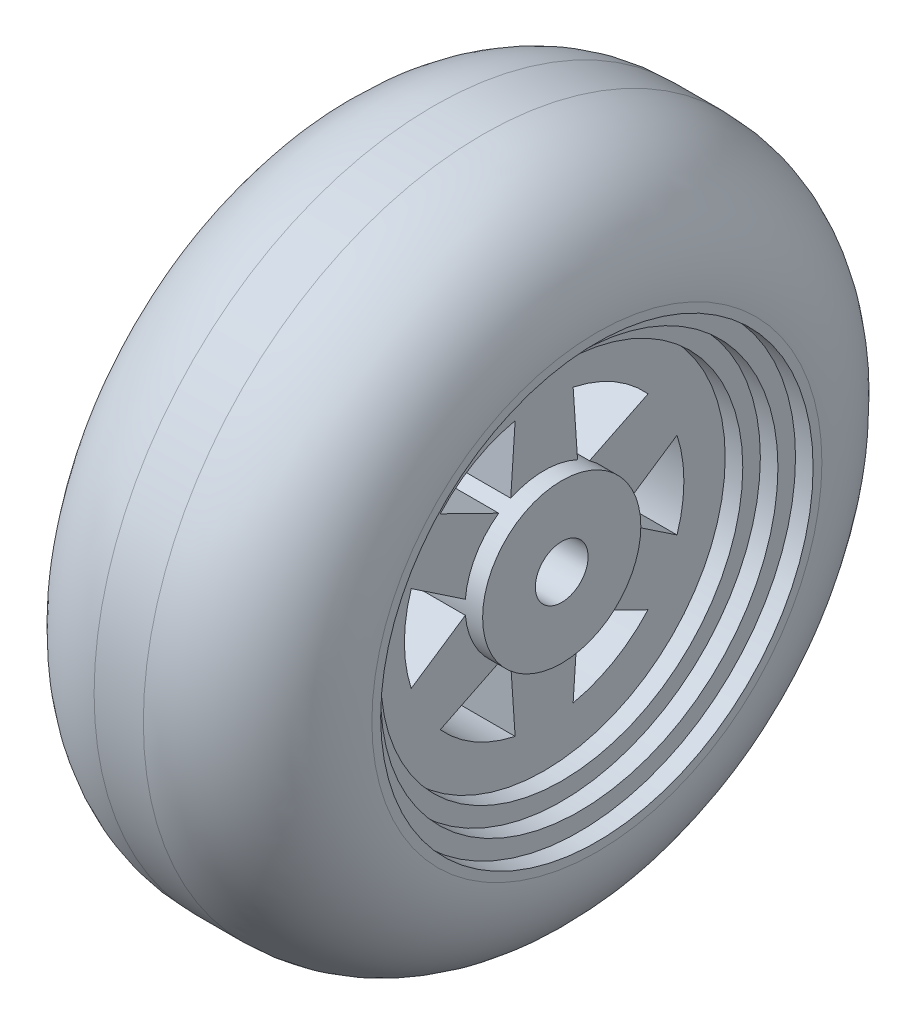
ISO-10303-21;
HEADER;
FILE_DESCRIPTION(('STEP AP214'),'2;1');
FILE_NAME('part.step','',(''),(''),'','','');
FILE_SCHEMA(('AUTOMOTIVE_DESIGN { 1 0 10303 214 1 1 1 1 }'));
ENDSEC;
DATA;
#1=APPLICATION_CONTEXT('core data for automotive mechanical design processes');
#2=APPLICATION_PROTOCOL_DEFINITION('international standard','automotive_design',2000,#1);
#3=PRODUCT_CONTEXT('',#1,'mechanical');
#4=PRODUCT('Part','Part','',(#3));
#5=PRODUCT_RELATED_PRODUCT_CATEGORY('part','',(#4));
#6=PRODUCT_DEFINITION_FORMATION('','',#4);
#7=PRODUCT_DEFINITION_CONTEXT('part definition',#1,'design');
#8=PRODUCT_DEFINITION('design','',#6,#7);
#9=PRODUCT_DEFINITION_SHAPE('','',#8);
#10=(LENGTH_UNIT() NAMED_UNIT(*) SI_UNIT(.MILLI.,.METRE.));
#11=(NAMED_UNIT(*) PLANE_ANGLE_UNIT() SI_UNIT($,.RADIAN.));
#12=(NAMED_UNIT(*) SI_UNIT($,.STERADIAN.) SOLID_ANGLE_UNIT());
#13=UNCERTAINTY_MEASURE_WITH_UNIT(LENGTH_MEASURE(1.E-05),#10,'distance_accuracy_value','');
#14=(GEOMETRIC_REPRESENTATION_CONTEXT(3) GLOBAL_UNCERTAINTY_ASSIGNED_CONTEXT((#13)) GLOBAL_UNIT_ASSIGNED_CONTEXT((#10,
#11,#12)) REPRESENTATION_CONTEXT('',''));
#15=CARTESIAN_POINT('',(0.,0.,0.));
#16=DIRECTION('',(0.,0.,1.));
#17=DIRECTION('',(1.,0.,0.));
#18=AXIS2_PLACEMENT_3D('',#15,#16,#17);
#19=CARTESIAN_POINT('',(12.8,0.,0.));
#20=DIRECTION('',(1.,0.,0.));
#21=DIRECTION('',(0.,0.,-1.));
#22=AXIS2_PLACEMENT_3D('',#19,#20,#21);
#23=PLANE('',#22);
#24=CARTESIAN_POINT('',(12.8,0.,0.));
#25=DIRECTION('',(1.,0.,0.));
#26=DIRECTION('',(0.,0.,-1.));
#27=AXIS2_PLACEMENT_3D('',#24,#25,#26);
#28=CIRCLE('',#27,10.3);
#29=CARTESIAN_POINT('',(12.8,0.,-10.3));
#30=VERTEX_POINT('',#29);
#31=EDGE_CURVE('E386',#30,#30,#28,.T.);
#32=ORIENTED_EDGE('',*,*,#31,.T.);
#33=EDGE_LOOP('',(#32));
#34=FACE_BOUND('',#33,.T.);
#35=DIRECTION('',(0.,-0.557279805700208,-0.830324766677918));
#36=VECTOR('',#35,1.);
#37=CARTESIAN_POINT('',(12.8,-0.394159538246702,-4.48270434653114));
#38=LINE('',#37,#36);
#39=CARTESIAN_POINT('',(12.8,-0.394159538246702,-4.48270434653114));
#40=VERTEX_POINT('',#39);
#41=CARTESIAN_POINT('',(12.8,-2.45950250280043,-7.55998329619309));
#42=VERTEX_POINT('',#41);
#43=EDGE_CURVE('E410',#40,#42,#38,.T.);
#44=ORIENTED_EDGE('',*,*,#43,.F.);
#45=CARTESIAN_POINT('',(12.8,0.,0.));
#46=DIRECTION('',(1.,0.,0.));
#47=DIRECTION('',(0.,0.,-1.));
#48=AXIS2_PLACEMENT_3D('',#45,#46,#47);
#49=CIRCLE('',#48,4.5);
#50=CARTESIAN_POINT('',(12.8,-3.68505607262756,-2.58270434653112));
#51=VERTEX_POINT('',#50);
#52=EDGE_CURVE('E269',#40,#51,#49,.F.);
#53=ORIENTED_EDGE('',*,*,#52,.T.);
#54=DIRECTION('',(0.,0.440442438484368,0.897780852091391));
#55=VECTOR('',#54,1.);
#56=CARTESIAN_POINT('',(12.8,-3.68505607262756,-2.58270434653112));
#57=LINE('',#56,#55);
#58=CARTESIAN_POINT('',(12.8,-5.31738633528907,-5.90998329619307));
#59=VERTEX_POINT('',#58);
#60=EDGE_CURVE('E404',#59,#51,#57,.T.);
#61=ORIENTED_EDGE('',*,*,#60,.F.);
#62=CARTESIAN_POINT('',(12.8,0.,0.));
#63=DIRECTION('',(1.,0.,0.));
#64=DIRECTION('',(0.,0.,-1.));
#65=AXIS2_PLACEMENT_3D('',#62,#63,#64);
#66=CIRCLE('',#65,7.95);
#67=CARTESIAN_POINT('',(12.8,-7.77688883808944,-1.64999999999994));
#68=VERTEX_POINT('',#67);
#69=EDGE_CURVE('E351',#68,#59,#66,.T.);
#70=ORIENTED_EDGE('',*,*,#69,.F.);
#71=DIRECTION('',(0.,-0.997722244184567,0.0674560854134801));
#72=VECTOR('',#71,1.);
#73=CARTESIAN_POINT('',(12.8,-4.07921561087424,-1.89999999999997));
#74=LINE('',#73,#72);
#75=CARTESIAN_POINT('',(12.8,-4.07921561087424,-1.89999999999997));
#76=VERTEX_POINT('',#75);
#77=EDGE_CURVE('E215',#76,#68,#74,.T.);
#78=ORIENTED_EDGE('',*,*,#77,.F.);
#79=CARTESIAN_POINT('',(12.8,-4.07921561087421,1.90000000000003));
#80=VERTEX_POINT('',#79);
#81=EDGE_CURVE('E272',#76,#80,#49,.F.);
#82=ORIENTED_EDGE('',*,*,#81,.T.);
#83=DIRECTION('',(0.,0.997722244184568,0.0674560854134662));
#84=VECTOR('',#83,1.);
#85=CARTESIAN_POINT('',(12.8,-4.07921561087421,1.90000000000003));
#86=LINE('',#85,#84);
#87=CARTESIAN_POINT('',(12.8,-7.77688883808942,1.65000000000005));
#88=VERTEX_POINT('',#87);
#89=EDGE_CURVE('E395',#88,#80,#86,.T.);
#90=ORIENTED_EDGE('',*,*,#89,.F.);
#91=CARTESIAN_POINT('',(12.8,0.,0.));
#92=DIRECTION('',(1.,0.,0.));
#93=DIRECTION('',(0.,0.,-1.));
#94=AXIS2_PLACEMENT_3D('',#91,#92,#93);
#95=CIRCLE('',#94,7.95);
#96=CARTESIAN_POINT('',(12.8,-5.31738633528898,5.90998329619314));
#97=VERTEX_POINT('',#96);
#98=EDGE_CURVE('E398',#97,#88,#95,.T.);
#99=ORIENTED_EDGE('',*,*,#98,.F.);
#100=DIRECTION('',(0.,-0.440442438484355,0.897780852091397));
#101=VECTOR('',#100,1.);
#102=CARTESIAN_POINT('',(12.8,-3.68505607262752,2.58270434653117));
#103=LINE('',#102,#101);
#104=CARTESIAN_POINT('',(12.8,-3.68505607262752,2.58270434653117));
#105=VERTEX_POINT('',#104);
#106=EDGE_CURVE('E401',#105,#97,#103,.T.);
#107=ORIENTED_EDGE('',*,*,#106,.F.);
#108=CARTESIAN_POINT('',(12.8,-0.394159538246828,4.48270434653113));
#109=VERTEX_POINT('',#108);
#110=EDGE_CURVE('E680',#105,#109,#49,.F.);
#111=ORIENTED_EDGE('',*,*,#110,.T.);
#112=DIRECTION('',(0.,0.557279805700205,-0.83032476667792));
#113=VECTOR('',#112,1.);
#114=CARTESIAN_POINT('',(12.8,-0.394159538246827,4.48270434653112));
#115=LINE('',#114,#113);
#116=CARTESIAN_POINT('',(12.8,-2.45950250280054,7.55998329619308));
#117=VERTEX_POINT('',#116);
#118=EDGE_CURVE('E258',#117,#109,#115,.T.);
#119=ORIENTED_EDGE('',*,*,#118,.F.);
#120=CARTESIAN_POINT('',(12.8,0.,0.));
#121=DIRECTION('',(1.,0.,0.));
#122=DIRECTION('',(0.,0.,-1.));
#123=AXIS2_PLACEMENT_3D('',#120,#121,#122);
#124=CIRCLE('',#123,7.95000000000002);
#125=CARTESIAN_POINT('',(12.8,2.45950250280049,7.55998329619308));
#126=VERTEX_POINT('',#125);
#127=EDGE_CURVE('E389',#126,#117,#124,.T.);
#128=ORIENTED_EDGE('',*,*,#127,.F.);
#129=DIRECTION('',(0.,0.557279805700214,0.830324766677914));
#130=VECTOR('',#129,1.);
#131=CARTESIAN_POINT('',(12.8,0.394159538246733,4.48270434653114));
#132=LINE('',#131,#130);
#133=CARTESIAN_POINT('',(12.8,0.394159538246732,4.48270434653113));
#134=VERTEX_POINT('',#133);
#135=EDGE_CURVE('E392',#134,#126,#132,.T.);
#136=ORIENTED_EDGE('',*,*,#135,.F.);
#137=CARTESIAN_POINT('',(12.8,3.68505607262758,2.5827043465311));
#138=VERTEX_POINT('',#137);
#139=EDGE_CURVE('E682',#134,#138,#49,.F.);
#140=ORIENTED_EDGE('',*,*,#139,.T.);
#141=DIRECTION('',(0.,-0.440442438484374,-0.897780852091388));
#142=VECTOR('',#141,1.);
#143=CARTESIAN_POINT('',(12.8,3.68505607262758,2.5827043465311));
#144=LINE('',#143,#142);
#145=CARTESIAN_POINT('',(12.8,5.31738633528911,5.90998329619303));
#146=VERTEX_POINT('',#145);
#147=EDGE_CURVE('E413',#146,#138,#144,.T.);
#148=ORIENTED_EDGE('',*,*,#147,.F.);
#149=CARTESIAN_POINT('',(12.8,0.,0.));
#150=DIRECTION('',(1.,0.,0.));
#151=DIRECTION('',(0.,0.,-1.));
#152=AXIS2_PLACEMENT_3D('',#149,#150,#151);
#153=CIRCLE('',#152,7.95);
#154=CARTESIAN_POINT('',(12.8,7.77688883808943,1.65));
#155=VERTEX_POINT('',#154);
#156=EDGE_CURVE('E416',#155,#146,#153,.T.);
#157=ORIENTED_EDGE('',*,*,#156,.F.);
#158=DIRECTION('',(0.,0.997722244184568,-0.0674560854134731));
#159=VECTOR('',#158,1.);
#160=CARTESIAN_POINT('',(12.8,4.07921561087423,1.9));
#161=LINE('',#160,#159);
#162=CARTESIAN_POINT('',(12.8,4.07921561087423,1.9));
#163=VERTEX_POINT('',#162);
#164=EDGE_CURVE('E419',#163,#155,#161,.T.);
#165=ORIENTED_EDGE('',*,*,#164,.F.);
#166=CARTESIAN_POINT('',(12.8,4.07921561087423,-1.9));
#167=VERTEX_POINT('',#166);
#168=EDGE_CURVE('E267',#163,#167,#49,.F.);
#169=ORIENTED_EDGE('',*,*,#168,.T.);
#170=DIRECTION('',(0.,-0.997722244184568,-0.0674560854134731));
#171=VECTOR('',#170,1.);
#172=CARTESIAN_POINT('',(12.8,4.07921561087423,-1.9));
#173=LINE('',#172,#171);
#174=CARTESIAN_POINT('',(12.8,7.77688883808943,-1.65));
#175=VERTEX_POINT('',#174);
#176=EDGE_CURVE('E422',#175,#167,#173,.T.);
#177=ORIENTED_EDGE('',*,*,#176,.F.);
#178=CARTESIAN_POINT('',(12.8,0.,0.));
#179=DIRECTION('',(1.,0.,0.));
#180=DIRECTION('',(0.,0.,-1.));
#181=AXIS2_PLACEMENT_3D('',#178,#179,#180);
#182=CIRCLE('',#181,7.95);
#183=CARTESIAN_POINT('',(12.8,5.31738633528903,-5.90998329619311));
#184=VERTEX_POINT('',#183);
#185=EDGE_CURVE('E425',#184,#175,#182,.T.);
#186=ORIENTED_EDGE('',*,*,#185,.F.);
#187=DIRECTION('',(0.,0.440442438484361,-0.897780852091394));
#188=VECTOR('',#187,1.);
#189=CARTESIAN_POINT('',(12.8,3.68505607262754,-2.58270434653115));
#190=LINE('',#189,#188);
#191=CARTESIAN_POINT('',(12.8,3.68505607262754,-2.58270434653115));
#192=VERTEX_POINT('',#191);
#193=EDGE_CURVE('E198',#192,#184,#190,.T.);
#194=ORIENTED_EDGE('',*,*,#193,.F.);
#195=CARTESIAN_POINT('',(12.8,0.,0.));
#196=DIRECTION('',(1.,0.,0.));
#197=DIRECTION('',(0.,0.,-1.));
#198=AXIS2_PLACEMENT_3D('',#195,#196,#197);
#199=CIRCLE('',#198,4.5);
#200=CARTESIAN_POINT('',(12.8,0.39415953824667,-4.48270434653114));
#201=VERTEX_POINT('',#200);
#202=EDGE_CURVE('E192',#201,#192,#199,.T.);
#203=ORIENTED_EDGE('',*,*,#202,.F.);
#204=DIRECTION('',(0.,-0.557279805700203,0.830324766677921));
#205=VECTOR('',#204,1.);
#206=CARTESIAN_POINT('',(12.8,0.39415953824667,-4.48270434653114));
#207=LINE('',#206,#205);
#208=CARTESIAN_POINT('',(12.8,2.45950250280037,-7.5599832961931));
#209=VERTEX_POINT('',#208);
#210=EDGE_CURVE('E195',#209,#201,#207,.T.);
#211=ORIENTED_EDGE('',*,*,#210,.F.);
#212=CARTESIAN_POINT('',(12.8,0.,0.));
#213=DIRECTION('',(1.,0.,0.));
#214=DIRECTION('',(0.,0.,-1.));
#215=AXIS2_PLACEMENT_3D('',#212,#213,#214);
#216=CIRCLE('',#215,7.95);
#217=EDGE_CURVE('E214',#42,#209,#216,.T.);
#218=ORIENTED_EDGE('',*,*,#217,.F.);
#219=EDGE_LOOP('',(#44,#53,#61,#70,#78,#82,#90,#99,#107,#111,#119,#128,#136,#140,#148,#157,#165,
#169,#177,#186,#194,#203,#211,#218));
#220=FACE_BOUND('',#219,.T.);
#221=ADVANCED_FACE('F31',(#34,#220),#23,.T.);
#222=CARTESIAN_POINT('',(1.,0.,0.));
#223=DIRECTION('',(-1.,0.,0.));
#224=DIRECTION('',(0.,0.,1.));
#225=AXIS2_PLACEMENT_3D('',#222,#223,#224);
#226=PLANE('',#225);
#227=CARTESIAN_POINT('',(1.,0.,0.));
#228=DIRECTION('',(-1.,0.,0.));
#229=DIRECTION('',(0.,0.,1.));
#230=AXIS2_PLACEMENT_3D('',#227,#228,#229);
#231=CIRCLE('',#230,12.3);
#232=CARTESIAN_POINT('',(1.,0.,12.3));
#233=VERTEX_POINT('',#232);
#234=EDGE_CURVE('E651',#233,#233,#231,.T.);
#235=ORIENTED_EDGE('',*,*,#234,.T.);
#236=EDGE_LOOP('',(#235));
#237=FACE_BOUND('',#236,.T.);
#238=DIRECTION('',(0.,-0.557279805700205,0.83032476667792));
#239=VECTOR('',#238,1.);
#240=CARTESIAN_POINT('',(1.,-0.394159538246827,4.48270434653112));
#241=LINE('',#240,#239);
#242=CARTESIAN_POINT('',(1.,-0.394159538246828,4.48270434653112));
#243=VERTEX_POINT('',#242);
#244=CARTESIAN_POINT('',(1.,-2.45950250280054,7.55998329619308));
#245=VERTEX_POINT('',#244);
#246=EDGE_CURVE('E261',#243,#245,#241,.T.);
#247=ORIENTED_EDGE('',*,*,#246,.F.);
#248=CARTESIAN_POINT('',(1.,0.,0.));
#249=DIRECTION('',(-1.,0.,0.));
#250=DIRECTION('',(0.,0.,1.));
#251=AXIS2_PLACEMENT_3D('',#248,#249,#250);
#252=CIRCLE('',#251,4.5);
#253=CARTESIAN_POINT('',(1.,-3.68505607262752,2.58270434653117));
#254=VERTEX_POINT('',#253);
#255=EDGE_CURVE('E265',#243,#254,#252,.F.);
#256=ORIENTED_EDGE('',*,*,#255,.T.);
#257=DIRECTION('',(0.,0.440442438484355,-0.897780852091397));
#258=VECTOR('',#257,1.);
#259=CARTESIAN_POINT('',(1.,-3.68505607262752,2.58270434653117));
#260=LINE('',#259,#258);
#261=CARTESIAN_POINT('',(1.,-5.31738633528898,5.90998329619314));
#262=VERTEX_POINT('',#261);
#263=EDGE_CURVE('E360',#262,#254,#260,.T.);
#264=ORIENTED_EDGE('',*,*,#263,.F.);
#265=CARTESIAN_POINT('',(1.,0.,0.));
#266=DIRECTION('',(-1.,0.,0.));
#267=DIRECTION('',(0.,0.,1.));
#268=AXIS2_PLACEMENT_3D('',#265,#266,#267);
#269=CIRCLE('',#268,7.95);
#270=CARTESIAN_POINT('',(1.,-7.77688883808942,1.65000000000005));
#271=VERTEX_POINT('',#270);
#272=EDGE_CURVE('E670',#271,#262,#269,.T.);
#273=ORIENTED_EDGE('',*,*,#272,.F.);
#274=DIRECTION('',(0.,-0.997722244184568,-0.0674560854134662));
#275=VECTOR('',#274,1.);
#276=CARTESIAN_POINT('',(1.,-4.07921561087421,1.90000000000003));
#277=LINE('',#276,#275);
#278=CARTESIAN_POINT('',(1.,-4.07921561087421,1.90000000000003));
#279=VERTEX_POINT('',#278);
#280=EDGE_CURVE('E667',#279,#271,#277,.T.);
#281=ORIENTED_EDGE('',*,*,#280,.F.);
#282=CARTESIAN_POINT('',(1.,-4.07921561087424,-1.89999999999997));
#283=VERTEX_POINT('',#282);
#284=EDGE_CURVE('E268',#279,#283,#252,.F.);
#285=ORIENTED_EDGE('',*,*,#284,.T.);
#286=DIRECTION('',(0.,0.997722244184567,-0.0674560854134801));
#287=VECTOR('',#286,1.);
#288=CARTESIAN_POINT('',(1.,-4.07921561087424,-1.89999999999997));
#289=LINE('',#288,#287);
#290=CARTESIAN_POINT('',(1.,-7.77688883808944,-1.64999999999994));
#291=VERTEX_POINT('',#290);
#292=EDGE_CURVE('E345',#291,#283,#289,.T.);
#293=ORIENTED_EDGE('',*,*,#292,.F.);
#294=CARTESIAN_POINT('',(1.,0.,0.));
#295=DIRECTION('',(-1.,0.,0.));
#296=DIRECTION('',(0.,0.,1.));
#297=AXIS2_PLACEMENT_3D('',#294,#295,#296);
#298=CIRCLE('',#297,7.95);
#299=CARTESIAN_POINT('',(1.,-5.31738633528907,-5.90998329619307));
#300=VERTEX_POINT('',#299);
#301=EDGE_CURVE('E353',#300,#291,#298,.T.);
#302=ORIENTED_EDGE('',*,*,#301,.F.);
#303=DIRECTION('',(0.,-0.440442438484368,-0.897780852091391));
#304=VECTOR('',#303,1.);
#305=CARTESIAN_POINT('',(1.,-3.68505607262756,-2.58270434653112));
#306=LINE('',#305,#304);
#307=CARTESIAN_POINT('',(1.,-3.68505607262756,-2.58270434653112));
#308=VERTEX_POINT('',#307);
#309=EDGE_CURVE('E356',#308,#300,#306,.T.);
#310=ORIENTED_EDGE('',*,*,#309,.F.);
#311=CARTESIAN_POINT('',(1.,-0.394159538246701,-4.48270434653114));
#312=VERTEX_POINT('',#311);
#313=EDGE_CURVE('E687',#308,#312,#252,.F.);
#314=ORIENTED_EDGE('',*,*,#313,.T.);
#315=DIRECTION('',(0.,0.557279805700208,0.830324766677918));
#316=VECTOR('',#315,1.);
#317=CARTESIAN_POINT('',(1.,-0.394159538246702,-4.48270434653114));
#318=LINE('',#317,#316);
#319=CARTESIAN_POINT('',(1.,-2.45950250280043,-7.55998329619309));
#320=VERTEX_POINT('',#319);
#321=EDGE_CURVE('E368',#320,#312,#318,.T.);
#322=ORIENTED_EDGE('',*,*,#321,.F.);
#323=CARTESIAN_POINT('',(1.,0.,0.));
#324=DIRECTION('',(-1.,0.,0.));
#325=DIRECTION('',(0.,0.,1.));
#326=AXIS2_PLACEMENT_3D('',#323,#324,#325);
#327=CIRCLE('',#326,7.95);
#328=CARTESIAN_POINT('',(1.,2.45950250280037,-7.5599832961931));
#329=VERTEX_POINT('',#328);
#330=EDGE_CURVE('E365',#329,#320,#327,.T.);
#331=ORIENTED_EDGE('',*,*,#330,.F.);
#332=DIRECTION('',(0.,0.557279805700203,-0.830324766677921));
#333=VECTOR('',#332,1.);
#334=CARTESIAN_POINT('',(1.,0.39415953824667,-4.48270434653114));
#335=LINE('',#334,#333);
#336=CARTESIAN_POINT('',(1.,0.39415953824667,-4.48270434653114));
#337=VERTEX_POINT('',#336);
#338=EDGE_CURVE('E358',#337,#329,#335,.T.);
#339=ORIENTED_EDGE('',*,*,#338,.F.);
#340=CARTESIAN_POINT('',(1.,3.68505607262754,-2.58270434653115));
#341=VERTEX_POINT('',#340);
#342=EDGE_CURVE('E219',#337,#341,#252,.F.);
#343=ORIENTED_EDGE('',*,*,#342,.T.);
#344=DIRECTION('',(0.,-0.440442438484361,0.897780852091394));
#345=VECTOR('',#344,1.);
#346=CARTESIAN_POINT('',(1.,3.68505607262754,-2.58270434653115));
#347=LINE('',#346,#345);
#348=CARTESIAN_POINT('',(1.,5.31738633528903,-5.90998329619311));
#349=VERTEX_POINT('',#348);
#350=EDGE_CURVE('E380',#349,#341,#347,.T.);
#351=ORIENTED_EDGE('',*,*,#350,.F.);
#352=CARTESIAN_POINT('',(1.,0.,0.));
#353=DIRECTION('',(-1.,0.,0.));
#354=DIRECTION('',(0.,0.,1.));
#355=AXIS2_PLACEMENT_3D('',#352,#353,#354);
#356=CIRCLE('',#355,7.95);
#357=CARTESIAN_POINT('',(1.,7.77688883808943,-1.65));
#358=VERTEX_POINT('',#357);
#359=EDGE_CURVE('E46',#358,#349,#356,.T.);
#360=ORIENTED_EDGE('',*,*,#359,.F.);
#361=DIRECTION('',(0.,0.997722244184568,0.0674560854134731));
#362=VECTOR('',#361,1.);
#363=CARTESIAN_POINT('',(1.,4.07921561087423,-1.9));
#364=LINE('',#363,#362);
#365=CARTESIAN_POINT('',(1.,4.07921561087423,-1.9));
#366=VERTEX_POINT('',#365);
#367=EDGE_CURVE('E377',#366,#358,#364,.T.);
#368=ORIENTED_EDGE('',*,*,#367,.F.);
#369=CARTESIAN_POINT('',(1.,4.07921561087423,1.9));
#370=VERTEX_POINT('',#369);
#371=EDGE_CURVE('E264',#366,#370,#252,.F.);
#372=ORIENTED_EDGE('',*,*,#371,.T.);
#373=DIRECTION('',(0.,-0.997722244184568,0.0674560854134731));
#374=VECTOR('',#373,1.);
#375=CARTESIAN_POINT('',(1.,4.07921561087423,1.9));
#376=LINE('',#375,#374);
#377=CARTESIAN_POINT('',(1.,7.77688883808943,1.65));
#378=VERTEX_POINT('',#377);
#379=EDGE_CURVE('E374',#378,#370,#376,.T.);
#380=ORIENTED_EDGE('',*,*,#379,.F.);
#381=CARTESIAN_POINT('',(1.,0.,0.));
#382=DIRECTION('',(-1.,0.,0.));
#383=DIRECTION('',(0.,0.,1.));
#384=AXIS2_PLACEMENT_3D('',#381,#382,#383);
#385=CIRCLE('',#384,7.95);
#386=CARTESIAN_POINT('',(1.,5.31738633528911,5.90998329619303));
#387=VERTEX_POINT('',#386);
#388=EDGE_CURVE('E53',#387,#378,#385,.T.);
#389=ORIENTED_EDGE('',*,*,#388,.F.);
#390=DIRECTION('',(0.,0.440442438484374,0.897780852091388));
#391=VECTOR('',#390,1.);
#392=CARTESIAN_POINT('',(1.,3.68505607262758,2.5827043465311));
#393=LINE('',#392,#391);
#394=CARTESIAN_POINT('',(1.,3.68505607262758,2.5827043465311));
#395=VERTEX_POINT('',#394);
#396=EDGE_CURVE('E371',#395,#387,#393,.T.);
#397=ORIENTED_EDGE('',*,*,#396,.F.);
#398=CARTESIAN_POINT('',(1.,0.,0.));
#399=DIRECTION('',(-1.,0.,0.));
#400=DIRECTION('',(0.,0.,1.));
#401=AXIS2_PLACEMENT_3D('',#398,#399,#400);
#402=CIRCLE('',#401,4.5);
#403=CARTESIAN_POINT('',(1.,0.394159538246732,4.48270434653113));
#404=VERTEX_POINT('',#403);
#405=EDGE_CURVE('E658',#404,#395,#402,.T.);
#406=ORIENTED_EDGE('',*,*,#405,.F.);
#407=DIRECTION('',(0.,-0.557279805700214,-0.830324766677914));
#408=VECTOR('',#407,1.);
#409=CARTESIAN_POINT('',(1.,0.394159538246733,4.48270434653114));
#410=LINE('',#409,#408);
#411=CARTESIAN_POINT('',(1.,2.45950250280049,7.55998329619308));
#412=VERTEX_POINT('',#411);
#413=EDGE_CURVE('E664',#412,#404,#410,.T.);
#414=ORIENTED_EDGE('',*,*,#413,.F.);
#415=CARTESIAN_POINT('',(1.,0.,0.));
#416=DIRECTION('',(-1.,0.,0.));
#417=DIRECTION('',(0.,0.,1.));
#418=AXIS2_PLACEMENT_3D('',#415,#416,#417);
#419=CIRCLE('',#418,7.95000000000002);
#420=EDGE_CURVE('E655',#245,#412,#419,.T.);
#421=ORIENTED_EDGE('',*,*,#420,.F.);
#422=EDGE_LOOP('',(#247,#256,#264,#273,#281,#285,#293,#302,#310,#314,#322,#331,#339,#343,#351,
#360,#368,#372,#380,#389,#397,#406,#414,#421));
#423=FACE_BOUND('',#422,.T.);
#424=ADVANCED_FACE('F447',(#237,#423),#226,.T.);
#425=CARTESIAN_POINT('',(15.8,3.68505607262754,-2.58270434653115));
#426=DIRECTION('',(0.,0.897780852091394,0.440442438484361));
#427=DIRECTION('',(0.,-0.440442438484361,0.897780852091394));
#428=AXIS2_PLACEMENT_3D('',#425,#426,#427);
#429=PLANE('',#428);
#430=DIRECTION('',(-1.,0.,0.));
#431=VECTOR('',#430,1.);
#432=CARTESIAN_POINT('',(15.8,5.31738633528903,-5.90998329619311));
#433=LINE('',#432,#431);
#434=EDGE_CURVE('E253',#184,#349,#433,.T.);
#435=ORIENTED_EDGE('',*,*,#434,.T.);
#436=ORIENTED_EDGE('',*,*,#350,.T.);
#437=DIRECTION('',(-1.,0.,0.));
#438=VECTOR('',#437,1.);
#439=CARTESIAN_POINT('',(15.8,3.68505607262754,-2.58270434653115));
#440=LINE('',#439,#438);
#441=EDGE_CURVE('E256',#192,#341,#440,.T.);
#442=ORIENTED_EDGE('',*,*,#441,.F.);
#443=ORIENTED_EDGE('',*,*,#193,.T.);
#444=EDGE_LOOP('',(#435,#436,#442,#443));
#445=FACE_BOUND('',#444,.T.);
#446=ADVANCED_FACE('F454',(#445),#429,.T.);
#447=CARTESIAN_POINT('',(15.8,0.,0.));
#448=DIRECTION('',(-1.,0.,0.));
#449=DIRECTION('',(0.,0.,1.));
#450=AXIS2_PLACEMENT_3D('',#447,#448,#449);
#451=CYLINDRICAL_SURFACE('',#450,7.95);
#452=DIRECTION('',(-1.,0.,0.));
#453=VECTOR('',#452,1.);
#454=CARTESIAN_POINT('',(15.8,7.77688883808943,-1.65));
#455=LINE('',#454,#453);
#456=EDGE_CURVE('E250',#175,#358,#455,.T.);
#457=ORIENTED_EDGE('',*,*,#456,.T.);
#458=ORIENTED_EDGE('',*,*,#359,.T.);
#459=ORIENTED_EDGE('',*,*,#434,.F.);
#460=ORIENTED_EDGE('',*,*,#185,.T.);
#461=EDGE_LOOP('',(#457,#458,#459,#460));
#462=FACE_BOUND('',#461,.T.);
#463=ADVANCED_FACE('F488',(#462),#451,.F.);
#464=CARTESIAN_POINT('',(15.8,4.07921561087423,-1.9));
#465=DIRECTION('',(0.,0.0674560854134731,-0.997722244184568));
#466=DIRECTION('',(0.,0.997722244184568,0.0674560854134731));
#467=AXIS2_PLACEMENT_3D('',#464,#465,#466);
#468=PLANE('',#467);
#469=DIRECTION('',(-1.,0.,0.));
#470=VECTOR('',#469,1.);
#471=CARTESIAN_POINT('',(15.8,4.07921561087423,-1.9));
#472=LINE('',#471,#470);
#473=EDGE_CURVE('E247',#167,#366,#472,.T.);
#474=ORIENTED_EDGE('',*,*,#473,.T.);
#475=ORIENTED_EDGE('',*,*,#367,.T.);
#476=ORIENTED_EDGE('',*,*,#456,.F.);
#477=ORIENTED_EDGE('',*,*,#176,.T.);
#478=EDGE_LOOP('',(#474,#475,#476,#477));
#479=FACE_BOUND('',#478,.T.);
#480=ADVANCED_FACE('F492',(#479),#468,.T.);
#481=CARTESIAN_POINT('',(15.8,4.07921561087423,1.9));
#482=DIRECTION('',(0.,0.0674560854134731,0.997722244184568));
#483=DIRECTION('',(0.,-0.997722244184568,0.0674560854134731));
#484=AXIS2_PLACEMENT_3D('',#481,#482,#483);
#485=PLANE('',#484);
#486=DIRECTION('',(-1.,0.,0.));
#487=VECTOR('',#486,1.);
#488=CARTESIAN_POINT('',(15.8,7.77688883808943,1.65));
#489=LINE('',#488,#487);
#490=EDGE_CURVE('E241',#155,#378,#489,.T.);
#491=ORIENTED_EDGE('',*,*,#490,.T.);
#492=ORIENTED_EDGE('',*,*,#379,.T.);
#493=DIRECTION('',(-1.,0.,0.));
#494=VECTOR('',#493,1.);
#495=CARTESIAN_POINT('',(15.8,4.07921561087423,1.9));
#496=LINE('',#495,#494);
#497=EDGE_CURVE('E244',#163,#370,#496,.T.);
#498=ORIENTED_EDGE('',*,*,#497,.F.);
#499=ORIENTED_EDGE('',*,*,#164,.T.);
#500=EDGE_LOOP('',(#491,#492,#498,#499));
#501=FACE_BOUND('',#500,.T.);
#502=ADVANCED_FACE('F504',(#501),#485,.T.);
#503=CARTESIAN_POINT('',(15.8,0.,0.));
#504=DIRECTION('',(-1.,0.,0.));
#505=DIRECTION('',(0.,0.,1.));
#506=AXIS2_PLACEMENT_3D('',#503,#504,#505);
#507=CYLINDRICAL_SURFACE('',#506,7.95);
#508=DIRECTION('',(-1.,0.,0.));
#509=VECTOR('',#508,1.);
#510=CARTESIAN_POINT('',(15.8,5.31738633528911,5.90998329619303));
#511=LINE('',#510,#509);
#512=EDGE_CURVE('E238',#146,#387,#511,.T.);
#513=ORIENTED_EDGE('',*,*,#512,.T.);
#514=ORIENTED_EDGE('',*,*,#388,.T.);
#515=ORIENTED_EDGE('',*,*,#490,.F.);
#516=ORIENTED_EDGE('',*,*,#156,.T.);
#517=EDGE_LOOP('',(#513,#514,#515,#516));
#518=FACE_BOUND('',#517,.T.);
#519=ADVANCED_FACE('F499',(#518),#507,.F.);
#520=CARTESIAN_POINT('',(15.8,3.68505607262758,2.5827043465311));
#521=DIRECTION('',(0.,0.897780852091388,-0.440442438484374));
#522=DIRECTION('',(0.,0.440442438484374,0.897780852091388));
#523=AXIS2_PLACEMENT_3D('',#520,#521,#522);
#524=PLANE('',#523);
#525=DIRECTION('',(-1.,0.,0.));
#526=VECTOR('',#525,1.);
#527=CARTESIAN_POINT('',(15.8,3.68505607262758,2.5827043465311));
#528=LINE('',#527,#526);
#529=EDGE_CURVE('E235',#138,#395,#528,.T.);
#530=ORIENTED_EDGE('',*,*,#529,.T.);
#531=ORIENTED_EDGE('',*,*,#396,.T.);
#532=ORIENTED_EDGE('',*,*,#512,.F.);
#533=ORIENTED_EDGE('',*,*,#147,.T.);
#534=EDGE_LOOP('',(#530,#531,#532,#533));
#535=FACE_BOUND('',#534,.T.);
#536=ADVANCED_FACE('F503',(#535),#524,.T.);
#537=CARTESIAN_POINT('',(15.8,-0.394159538246702,-4.48270434653114));
#538=DIRECTION('',(0.,0.830324766677918,-0.557279805700208));
#539=DIRECTION('',(0.,0.557279805700208,0.830324766677918));
#540=AXIS2_PLACEMENT_3D('',#537,#538,#539);
#541=PLANE('',#540);
#542=DIRECTION('',(-1.,0.,0.));
#543=VECTOR('',#542,1.);
#544=CARTESIAN_POINT('',(15.8,-2.45950250280043,-7.55998329619309));
#545=LINE('',#544,#543);
#546=EDGE_CURVE('E223',#42,#320,#545,.T.);
#547=ORIENTED_EDGE('',*,*,#546,.T.);
#548=ORIENTED_EDGE('',*,*,#321,.T.);
#549=DIRECTION('',(-1.,0.,0.));
#550=VECTOR('',#549,1.);
#551=CARTESIAN_POINT('',(15.8,-0.394159538246702,-4.48270434653114));
#552=LINE('',#551,#550);
#553=EDGE_CURVE('E232',#40,#312,#552,.T.);
#554=ORIENTED_EDGE('',*,*,#553,.F.);
#555=ORIENTED_EDGE('',*,*,#43,.T.);
#556=EDGE_LOOP('',(#547,#548,#554,#555));
#557=FACE_BOUND('',#556,.T.);
#558=ADVANCED_FACE('F515',(#557),#541,.T.);
#559=CARTESIAN_POINT('',(15.8,0.,0.));
#560=DIRECTION('',(-1.,0.,0.));
#561=DIRECTION('',(0.,0.,1.));
#562=AXIS2_PLACEMENT_3D('',#559,#560,#561);
#563=CYLINDRICAL_SURFACE('',#562,7.95);
#564=DIRECTION('',(-1.,0.,0.));
#565=VECTOR('',#564,1.);
#566=CARTESIAN_POINT('',(15.8,2.45950250280037,-7.5599832961931));
#567=LINE('',#566,#565);
#568=EDGE_CURVE('E213',#209,#329,#567,.T.);
#569=ORIENTED_EDGE('',*,*,#568,.T.);
#570=ORIENTED_EDGE('',*,*,#330,.T.);
#571=ORIENTED_EDGE('',*,*,#546,.F.);
#572=ORIENTED_EDGE('',*,*,#217,.T.);
#573=EDGE_LOOP('',(#569,#570,#571,#572));
#574=FACE_BOUND('',#573,.T.);
#575=ADVANCED_FACE('F511',(#574),#563,.F.);
#576=CARTESIAN_POINT('',(15.8,0.39415953824667,-4.48270434653114));
#577=DIRECTION('',(0.,-0.830324766677921,-0.557279805700203));
#578=DIRECTION('',(0.,0.557279805700203,-0.830324766677921));
#579=AXIS2_PLACEMENT_3D('',#576,#577,#578);
#580=PLANE('',#579);
#581=DIRECTION('',(-1.,0.,0.));
#582=VECTOR('',#581,1.);
#583=CARTESIAN_POINT('',(15.8,0.39415953824667,-4.48270434653114));
#584=LINE('',#583,#582);
#585=EDGE_CURVE('E211',#201,#337,#584,.T.);
#586=ORIENTED_EDGE('',*,*,#585,.T.);
#587=ORIENTED_EDGE('',*,*,#338,.T.);
#588=ORIENTED_EDGE('',*,*,#568,.F.);
#589=ORIENTED_EDGE('',*,*,#210,.T.);
#590=EDGE_LOOP('',(#586,#587,#588,#589));
#591=FACE_BOUND('',#590,.T.);
#592=ADVANCED_FACE('F209',(#591),#580,.T.);
#593=CARTESIAN_POINT('',(15.8,-4.07921561087424,-1.89999999999997));
#594=DIRECTION('',(0.,-0.0674560854134801,-0.997722244184567));
#595=DIRECTION('',(0.,0.997722244184567,-0.0674560854134801));
#596=AXIS2_PLACEMENT_3D('',#593,#594,#595);
#597=PLANE('',#596);
#598=DIRECTION('',(-1.,0.,0.));
#599=VECTOR('',#598,1.);
#600=CARTESIAN_POINT('',(15.8,-7.77688883808944,-1.64999999999994));
#601=LINE('',#600,#599);
#602=EDGE_CURVE('E226',#68,#291,#601,.T.);
#603=ORIENTED_EDGE('',*,*,#602,.T.);
#604=ORIENTED_EDGE('',*,*,#292,.T.);
#605=DIRECTION('',(-1.,0.,0.));
#606=VECTOR('',#605,1.);
#607=CARTESIAN_POINT('',(15.8,-4.07921561087424,-1.89999999999997));
#608=LINE('',#607,#606);
#609=EDGE_CURVE('E221',#76,#283,#608,.T.);
#610=ORIENTED_EDGE('',*,*,#609,.F.);
#611=ORIENTED_EDGE('',*,*,#77,.T.);
#612=EDGE_LOOP('',(#603,#604,#610,#611));
#613=FACE_BOUND('',#612,.T.);
#614=ADVANCED_FACE('F343',(#613),#597,.T.);
#615=CARTESIAN_POINT('',(15.8,0.,0.));
#616=DIRECTION('',(-1.,0.,0.));
#617=DIRECTION('',(0.,0.,1.));
#618=AXIS2_PLACEMENT_3D('',#615,#616,#617);
#619=CYLINDRICAL_SURFACE('',#618,7.95);
#620=DIRECTION('',(-1.,0.,0.));
#621=VECTOR('',#620,1.);
#622=CARTESIAN_POINT('',(15.8,-5.31738633528907,-5.90998329619307));
#623=LINE('',#622,#621);
#624=EDGE_CURVE('E336',#59,#300,#623,.T.);
#625=ORIENTED_EDGE('',*,*,#624,.T.);
#626=ORIENTED_EDGE('',*,*,#301,.T.);
#627=ORIENTED_EDGE('',*,*,#602,.F.);
#628=ORIENTED_EDGE('',*,*,#69,.T.);
#629=EDGE_LOOP('',(#625,#626,#627,#628));
#630=FACE_BOUND('',#629,.T.);
#631=ADVANCED_FACE('F350',(#630),#619,.F.);
#632=CARTESIAN_POINT('',(15.8,-3.68505607262756,-2.58270434653112));
#633=DIRECTION('',(0.,-0.897780852091391,0.440442438484367));
#634=DIRECTION('',(0.,-0.440442438484368,-0.897780852091391));
#635=AXIS2_PLACEMENT_3D('',#632,#633,#634);
#636=PLANE('',#635);
#637=DIRECTION('',(-1.,0.,0.));
#638=VECTOR('',#637,1.);
#639=CARTESIAN_POINT('',(15.8,-3.68505607262756,-2.58270434653112));
#640=LINE('',#639,#638);
#641=EDGE_CURVE('E333',#51,#308,#640,.T.);
#642=ORIENTED_EDGE('',*,*,#641,.T.);
#643=ORIENTED_EDGE('',*,*,#309,.T.);
#644=ORIENTED_EDGE('',*,*,#624,.F.);
#645=ORIENTED_EDGE('',*,*,#60,.T.);
#646=EDGE_LOOP('',(#642,#643,#644,#645));
#647=FACE_BOUND('',#646,.T.);
#648=ADVANCED_FACE('F525',(#647),#636,.T.);
#649=CARTESIAN_POINT('',(15.8,-3.68505607262752,2.58270434653117));
#650=DIRECTION('',(0.,-0.897780852091397,-0.440442438484355));
#651=DIRECTION('',(0.,0.440442438484355,-0.897780852091397));
#652=AXIS2_PLACEMENT_3D('',#649,#650,#651);
#653=PLANE('',#652);
#654=DIRECTION('',(-1.,0.,0.));
#655=VECTOR('',#654,1.);
#656=CARTESIAN_POINT('',(15.8,-5.31738633528898,5.90998329619314));
#657=LINE('',#656,#655);
#658=EDGE_CURVE('E327',#97,#262,#657,.T.);
#659=ORIENTED_EDGE('',*,*,#658,.T.);
#660=ORIENTED_EDGE('',*,*,#263,.T.);
#661=DIRECTION('',(-1.,0.,0.));
#662=VECTOR('',#661,1.);
#663=CARTESIAN_POINT('',(15.8,-3.68505607262752,2.58270434653117));
#664=LINE('',#663,#662);
#665=EDGE_CURVE('E330',#105,#254,#664,.T.);
#666=ORIENTED_EDGE('',*,*,#665,.F.);
#667=ORIENTED_EDGE('',*,*,#106,.T.);
#668=EDGE_LOOP('',(#659,#660,#666,#667));
#669=FACE_BOUND('',#668,.T.);
#670=ADVANCED_FACE('F536',(#669),#653,.T.);
#671=CARTESIAN_POINT('',(15.8,0.,0.));
#672=DIRECTION('',(-1.,0.,0.));
#673=DIRECTION('',(0.,0.,1.));
#674=AXIS2_PLACEMENT_3D('',#671,#672,#673);
#675=CYLINDRICAL_SURFACE('',#674,7.95);
#676=DIRECTION('',(-1.,0.,0.));
#677=VECTOR('',#676,1.);
#678=CARTESIAN_POINT('',(15.8,-7.77688883808942,1.65000000000005));
#679=LINE('',#678,#677);
#680=EDGE_CURVE('E324',#88,#271,#679,.T.);
#681=ORIENTED_EDGE('',*,*,#680,.T.);
#682=ORIENTED_EDGE('',*,*,#272,.T.);
#683=ORIENTED_EDGE('',*,*,#658,.F.);
#684=ORIENTED_EDGE('',*,*,#98,.T.);
#685=EDGE_LOOP('',(#681,#682,#683,#684));
#686=FACE_BOUND('',#685,.T.);
#687=ADVANCED_FACE('F531',(#686),#675,.F.);
#688=CARTESIAN_POINT('',(15.8,-4.07921561087421,1.90000000000003));
#689=DIRECTION('',(0.,-0.0674560854134662,0.997722244184568));
#690=DIRECTION('',(0.,-0.997722244184568,-0.0674560854134662));
#691=AXIS2_PLACEMENT_3D('',#688,#689,#690);
#692=PLANE('',#691);
#693=DIRECTION('',(-1.,0.,0.));
#694=VECTOR('',#693,1.);
#695=CARTESIAN_POINT('',(15.8,-4.07921561087421,1.90000000000003));
#696=LINE('',#695,#694);
#697=EDGE_CURVE('E321',#80,#279,#696,.T.);
#698=ORIENTED_EDGE('',*,*,#697,.T.);
#699=ORIENTED_EDGE('',*,*,#280,.T.);
#700=ORIENTED_EDGE('',*,*,#680,.F.);
#701=ORIENTED_EDGE('',*,*,#89,.T.);
#702=EDGE_LOOP('',(#698,#699,#700,#701));
#703=FACE_BOUND('',#702,.T.);
#704=ADVANCED_FACE('F535',(#703),#692,.T.);
#705=CARTESIAN_POINT('',(15.8,0.,0.));
#706=DIRECTION('',(-1.,0.,0.));
#707=DIRECTION('',(0.,0.,1.));
#708=AXIS2_PLACEMENT_3D('',#705,#706,#707);
#709=CYLINDRICAL_SURFACE('',#708,4.5);
#710=ORIENTED_EDGE('',*,*,#81,.F.);
#711=ORIENTED_EDGE('',*,*,#609,.T.);
#712=ORIENTED_EDGE('',*,*,#284,.F.);
#713=ORIENTED_EDGE('',*,*,#697,.F.);
#714=EDGE_LOOP('',(#710,#711,#712,#713));
#715=FACE_BOUND('',#714,.T.);
#716=ORIENTED_EDGE('',*,*,#110,.F.);
#717=ORIENTED_EDGE('',*,*,#665,.T.);
#718=ORIENTED_EDGE('',*,*,#255,.F.);
#719=DIRECTION('',(-1.,0.,0.));
#720=VECTOR('',#719,1.);
#721=CARTESIAN_POINT('',(15.8,-0.394159538246827,4.48270434653112));
#722=LINE('',#721,#720);
#723=EDGE_CURVE('E303',#109,#243,#722,.T.);
#724=ORIENTED_EDGE('',*,*,#723,.F.);
#725=EDGE_LOOP('',(#716,#717,#718,#724));
#726=FACE_BOUND('',#725,.T.);
#727=ORIENTED_EDGE('',*,*,#139,.F.);
#728=DIRECTION('',(-1.,0.,0.));
#729=VECTOR('',#728,1.);
#730=CARTESIAN_POINT('',(15.8,0.394159538246733,4.48270434653114));
#731=LINE('',#730,#729);
#732=EDGE_CURVE('E318',#134,#404,#731,.T.);
#733=ORIENTED_EDGE('',*,*,#732,.T.);
#734=ORIENTED_EDGE('',*,*,#405,.T.);
#735=ORIENTED_EDGE('',*,*,#529,.F.);
#736=EDGE_LOOP('',(#727,#733,#734,#735));
#737=FACE_BOUND('',#736,.T.);
#738=ORIENTED_EDGE('',*,*,#168,.F.);
#739=ORIENTED_EDGE('',*,*,#497,.T.);
#740=ORIENTED_EDGE('',*,*,#371,.F.);
#741=ORIENTED_EDGE('',*,*,#473,.F.);
#742=EDGE_LOOP('',(#738,#739,#740,#741));
#743=FACE_BOUND('',#742,.T.);
#744=ORIENTED_EDGE('',*,*,#202,.T.);
#745=ORIENTED_EDGE('',*,*,#441,.T.);
#746=ORIENTED_EDGE('',*,*,#342,.F.);
#747=ORIENTED_EDGE('',*,*,#585,.F.);
#748=EDGE_LOOP('',(#744,#745,#746,#747));
#749=FACE_BOUND('',#748,.T.);
#750=ORIENTED_EDGE('',*,*,#641,.F.);
#751=ORIENTED_EDGE('',*,*,#52,.F.);
#752=ORIENTED_EDGE('',*,*,#553,.T.);
#753=ORIENTED_EDGE('',*,*,#313,.F.);
#754=EDGE_LOOP('',(#750,#751,#752,#753));
#755=FACE_BOUND('',#754,.T.);
#756=CARTESIAN_POINT('',(-4.,0.,0.));
#757=DIRECTION('',(-1.,0.,0.));
#758=DIRECTION('',(0.,0.,1.));
#759=AXIS2_PLACEMENT_3D('',#756,#757,#758);
#760=CIRCLE('',#759,4.5);
#761=CARTESIAN_POINT('',(-4.,0.,4.5));
#762=VERTEX_POINT('',#761);
#763=EDGE_CURVE('E652',#762,#762,#760,.T.);
#764=ORIENTED_EDGE('',*,*,#763,.F.);
#765=EDGE_LOOP('',(#764));
#766=FACE_BOUND('',#765,.T.);
#767=CARTESIAN_POINT('',(13.8,0.,0.));
#768=DIRECTION('',(1.,0.,0.));
#769=DIRECTION('',(0.,0.,-1.));
#770=AXIS2_PLACEMENT_3D('',#767,#768,#769);
#771=CIRCLE('',#770,4.5);
#772=CARTESIAN_POINT('',(13.8,0.,-4.5));
#773=VERTEX_POINT('',#772);
#774=EDGE_CURVE('E203',#773,#773,#771,.T.);
#775=ORIENTED_EDGE('',*,*,#774,.F.);
#776=EDGE_LOOP('',(#775));
#777=FACE_BOUND('',#776,.T.);
#778=ADVANCED_FACE('F217',(#715,#726,#737,#743,#749,#755,#766,#777),#709,.T.);
#779=CARTESIAN_POINT('',(15.8,0.394159538246733,4.48270434653114));
#780=DIRECTION('',(0.,-0.830324766677914,0.557279805700214));
#781=DIRECTION('',(0.,-0.557279805700214,-0.830324766677914));
#782=AXIS2_PLACEMENT_3D('',#779,#780,#781);
#783=PLANE('',#782);
#784=DIRECTION('',(-1.,0.,0.));
#785=VECTOR('',#784,1.);
#786=CARTESIAN_POINT('',(15.8,2.45950250280049,7.55998329619308));
#787=LINE('',#786,#785);
#788=EDGE_CURVE('E315',#126,#412,#787,.T.);
#789=ORIENTED_EDGE('',*,*,#788,.T.);
#790=ORIENTED_EDGE('',*,*,#413,.T.);
#791=ORIENTED_EDGE('',*,*,#732,.F.);
#792=ORIENTED_EDGE('',*,*,#135,.T.);
#793=EDGE_LOOP('',(#789,#790,#791,#792));
#794=FACE_BOUND('',#793,.T.);
#795=ADVANCED_FACE('F547',(#794),#783,.T.);
#796=CARTESIAN_POINT('',(15.8,0.,0.));
#797=DIRECTION('',(-1.,0.,0.));
#798=DIRECTION('',(0.,0.,1.));
#799=AXIS2_PLACEMENT_3D('',#796,#797,#798);
#800=CYLINDRICAL_SURFACE('',#799,7.95000000000002);
#801=DIRECTION('',(-1.,0.,0.));
#802=VECTOR('',#801,1.);
#803=CARTESIAN_POINT('',(15.8,-2.45950250280054,7.55998329619308));
#804=LINE('',#803,#802);
#805=EDGE_CURVE('E312',#117,#245,#804,.T.);
#806=ORIENTED_EDGE('',*,*,#805,.T.);
#807=ORIENTED_EDGE('',*,*,#420,.T.);
#808=ORIENTED_EDGE('',*,*,#788,.F.);
#809=ORIENTED_EDGE('',*,*,#127,.T.);
#810=EDGE_LOOP('',(#806,#807,#808,#809));
#811=FACE_BOUND('',#810,.T.);
#812=ADVANCED_FACE('F543',(#811),#800,.F.);
#813=CARTESIAN_POINT('',(15.8,-0.394159538246827,4.48270434653112));
#814=DIRECTION('',(0.,0.83032476667792,0.557279805700205));
#815=DIRECTION('',(0.,-0.557279805700205,0.83032476667792));
#816=AXIS2_PLACEMENT_3D('',#813,#814,#815);
#817=PLANE('',#816);
#818=ORIENTED_EDGE('',*,*,#723,.T.);
#819=ORIENTED_EDGE('',*,*,#246,.T.);
#820=ORIENTED_EDGE('',*,*,#805,.F.);
#821=ORIENTED_EDGE('',*,*,#118,.T.);
#822=EDGE_LOOP('',(#818,#819,#820,#821));
#823=FACE_BOUND('',#822,.T.);
#824=ADVANCED_FACE('F294',(#823),#817,.T.);
#825=CARTESIAN_POINT('',(15.8,0.,0.));
#826=DIRECTION('',(1.,0.,0.));
#827=DIRECTION('',(0.,0.,-1.));
#828=AXIS2_PLACEMENT_3D('',#825,#826,#827);
#829=PLANE('',#828);
#830=CARTESIAN_POINT('',(15.8,0.,0.));
#831=DIRECTION('',(1.,0.,0.));
#832=DIRECTION('',(0.,0.,-1.));
#833=AXIS2_PLACEMENT_3D('',#830,#831,#832);
#834=CIRCLE('',#833,12.8);
#835=CARTESIAN_POINT('',(15.8,0.,-12.8));
#836=VERTEX_POINT('',#835);
#837=EDGE_CURVE('E271',#836,#836,#834,.T.);
#838=ORIENTED_EDGE('',*,*,#837,.T.);
#839=EDGE_LOOP('',(#838));
#840=FACE_BOUND('',#839,.T.);
#841=CARTESIAN_POINT('',(15.8,0.,0.));
#842=DIRECTION('',(1.,0.,0.));
#843=DIRECTION('',(0.,0.,-1.));
#844=AXIS2_PLACEMENT_3D('',#841,#842,#843);
#845=CIRCLE('',#844,12.3);
#846=CARTESIAN_POINT('',(15.8,0.,-12.3));
#847=VERTEX_POINT('',#846);
#848=EDGE_CURVE('E297',#847,#847,#845,.T.);
#849=ORIENTED_EDGE('',*,*,#848,.F.);
#850=EDGE_LOOP('',(#849));
#851=FACE_BOUND('',#850,.T.);
#852=ADVANCED_FACE('F290',(#840,#851),#829,.T.);
#853=CARTESIAN_POINT('',(0.,0.,0.));
#854=DIRECTION('',(1.,0.,0.));
#855=DIRECTION('',(0.,0.,-1.));
#856=AXIS2_PLACEMENT_3D('',#853,#854,#855);
#857=PLANE('',#856);
#858=CARTESIAN_POINT('',(0.,0.,0.));
#859=DIRECTION('',(1.,0.,0.));
#860=DIRECTION('',(0.,0.,-1.));
#861=AXIS2_PLACEMENT_3D('',#858,#859,#860);
#862=CIRCLE('',#861,12.8);
#863=CARTESIAN_POINT('',(0.,0.,-12.8));
#864=VERTEX_POINT('',#863);
#865=EDGE_CURVE('E11',#864,#864,#862,.F.);
#866=ORIENTED_EDGE('',*,*,#865,.T.);
#867=EDGE_LOOP('',(#866));
#868=FACE_BOUND('',#867,.T.);
#869=CARTESIAN_POINT('',(0.,0.,0.));
#870=DIRECTION('',(-1.,0.,0.));
#871=DIRECTION('',(0.,0.,1.));
#872=AXIS2_PLACEMENT_3D('',#869,#870,#871);
#873=CIRCLE('',#872,12.3);
#874=CARTESIAN_POINT('',(0.,0.,12.3));
#875=VERTEX_POINT('',#874);
#876=EDGE_CURVE('E649',#875,#875,#873,.T.);
#877=ORIENTED_EDGE('',*,*,#876,.F.);
#878=EDGE_LOOP('',(#877));
#879=FACE_BOUND('',#878,.T.);
#880=ADVANCED_FACE('F293',(#868,#879),#857,.F.);
#881=CARTESIAN_POINT('',(15.8,0.,0.));
#882=DIRECTION('',(-1.,0.,0.));
#883=DIRECTION('',(0.,0.,1.));
#884=AXIS2_PLACEMENT_3D('',#881,#882,#883);
#885=CYLINDRICAL_SURFACE('',#884,19.3);
#886=CARTESIAN_POINT('',(9.3,0.,0.));
#887=DIRECTION('',(1.,0.,0.));
#888=DIRECTION('',(0.,0.,-1.));
#889=AXIS2_PLACEMENT_3D('',#886,#887,#888);
#890=CIRCLE('',#889,19.3);
#891=CARTESIAN_POINT('',(9.3,0.,-19.3));
#892=VERTEX_POINT('',#891);
#893=EDGE_CURVE('E39',#892,#892,#890,.F.);
#894=ORIENTED_EDGE('',*,*,#893,.T.);
#895=EDGE_LOOP('',(#894));
#896=FACE_BOUND('',#895,.T.);
#897=CARTESIAN_POINT('',(6.5,0.,0.));
#898=DIRECTION('',(1.,0.,0.));
#899=DIRECTION('',(0.,0.,-1.));
#900=AXIS2_PLACEMENT_3D('',#897,#898,#899);
#901=CIRCLE('',#900,19.3);
#902=CARTESIAN_POINT('',(6.5,0.,-19.3));
#903=VERTEX_POINT('',#902);
#904=EDGE_CURVE('E275',#903,#903,#901,.T.);
#905=ORIENTED_EDGE('',*,*,#904,.T.);
#906=EDGE_LOOP('',(#905));
#907=FACE_BOUND('',#906,.T.);
#908=ADVANCED_FACE('F33',(#896,#907),#885,.T.);
#909=CARTESIAN_POINT('',(14.8,0.,0.));
#910=DIRECTION('',(1.,0.,0.));
#911=DIRECTION('',(0.,0.,-1.));
#912=AXIS2_PLACEMENT_3D('',#909,#910,#911);
#913=CYLINDRICAL_SURFACE('',#912,12.3);
#914=CARTESIAN_POINT('',(14.8,0.,0.));
#915=DIRECTION('',(1.,0.,0.));
#916=DIRECTION('',(0.,0.,-1.));
#917=AXIS2_PLACEMENT_3D('',#914,#915,#916);
#918=CIRCLE('',#917,12.3);
#919=CARTESIAN_POINT('',(14.8,0.,-12.3));
#920=VERTEX_POINT('',#919);
#921=EDGE_CURVE('E299',#920,#920,#918,.T.);
#922=ORIENTED_EDGE('',*,*,#921,.F.);
#923=EDGE_LOOP('',(#922));
#924=FACE_BOUND('',#923,.T.);
#925=ORIENTED_EDGE('',*,*,#848,.T.);
#926=EDGE_LOOP('',(#925));
#927=FACE_BOUND('',#926,.T.);
#928=ADVANCED_FACE('F436',(#924,#927),#913,.F.);
#929=CARTESIAN_POINT('',(14.8,0.,0.));
#930=DIRECTION('',(1.,0.,0.));
#931=DIRECTION('',(0.,0.,-1.));
#932=AXIS2_PLACEMENT_3D('',#929,#930,#931);
#933=PLANE('',#932);
#934=CARTESIAN_POINT('',(14.8,0.,0.));
#935=DIRECTION('',(1.,0.,0.));
#936=DIRECTION('',(0.,0.,-1.));
#937=AXIS2_PLACEMENT_3D('',#934,#935,#936);
#938=CIRCLE('',#937,11.3);
#939=CARTESIAN_POINT('',(14.8,0.,-11.3));
#940=VERTEX_POINT('',#939);
#941=EDGE_CURVE('E306',#940,#940,#938,.T.);
#942=ORIENTED_EDGE('',*,*,#941,.F.);
#943=EDGE_LOOP('',(#942));
#944=FACE_BOUND('',#943,.T.);
#945=ORIENTED_EDGE('',*,*,#921,.T.);
#946=EDGE_LOOP('',(#945));
#947=FACE_BOUND('',#946,.T.);
#948=ADVANCED_FACE('F433',(#944,#947),#933,.T.);
#949=CARTESIAN_POINT('',(13.8,0.,0.));
#950=DIRECTION('',(1.,0.,0.));
#951=DIRECTION('',(0.,0.,-1.));
#952=AXIS2_PLACEMENT_3D('',#949,#950,#951);
#953=CYLINDRICAL_SURFACE('',#952,11.3);
#954=CARTESIAN_POINT('',(13.8,0.,0.));
#955=DIRECTION('',(1.,0.,0.));
#956=DIRECTION('',(0.,0.,-1.));
#957=AXIS2_PLACEMENT_3D('',#954,#955,#956);
#958=CIRCLE('',#957,11.3);
#959=CARTESIAN_POINT('',(13.8,0.,-11.3));
#960=VERTEX_POINT('',#959);
#961=EDGE_CURVE('E300',#960,#960,#958,.T.);
#962=ORIENTED_EDGE('',*,*,#961,.F.);
#963=EDGE_LOOP('',(#962));
#964=FACE_BOUND('',#963,.T.);
#965=ORIENTED_EDGE('',*,*,#941,.T.);
#966=EDGE_LOOP('',(#965));
#967=FACE_BOUND('',#966,.T.);
#968=ADVANCED_FACE('F431',(#964,#967),#953,.F.);
#969=CARTESIAN_POINT('',(13.8,0.,0.));
#970=DIRECTION('',(1.,0.,0.));
#971=DIRECTION('',(0.,0.,-1.));
#972=AXIS2_PLACEMENT_3D('',#969,#970,#971);
#973=PLANE('',#972);
#974=CARTESIAN_POINT('',(13.8,0.,0.));
#975=DIRECTION('',(1.,0.,0.));
#976=DIRECTION('',(0.,0.,-1.));
#977=AXIS2_PLACEMENT_3D('',#974,#975,#976);
#978=CIRCLE('',#977,10.3);
#979=CARTESIAN_POINT('',(13.8,0.,-10.3));
#980=VERTEX_POINT('',#979);
#981=EDGE_CURVE('E383',#980,#980,#978,.T.);
#982=ORIENTED_EDGE('',*,*,#981,.F.);
#983=EDGE_LOOP('',(#982));
#984=FACE_BOUND('',#983,.T.);
#985=ORIENTED_EDGE('',*,*,#961,.T.);
#986=EDGE_LOOP('',(#985));
#987=FACE_BOUND('',#986,.T.);
#988=ADVANCED_FACE('F463',(#984,#987),#973,.T.);
#989=CARTESIAN_POINT('',(12.8,0.,0.));
#990=DIRECTION('',(1.,0.,0.));
#991=DIRECTION('',(0.,0.,-1.));
#992=AXIS2_PLACEMENT_3D('',#989,#990,#991);
#993=CYLINDRICAL_SURFACE('',#992,10.3);
#994=ORIENTED_EDGE('',*,*,#31,.F.);
#995=EDGE_LOOP('',(#994));
#996=FACE_BOUND('',#995,.T.);
#997=ORIENTED_EDGE('',*,*,#981,.T.);
#998=EDGE_LOOP('',(#997));
#999=FACE_BOUND('',#998,.T.);
#1000=ADVANCED_FACE('F460',(#996,#999),#993,.F.);
#1001=CARTESIAN_POINT('',(1.,0.,0.));
#1002=DIRECTION('',(-1.,0.,0.));
#1003=DIRECTION('',(0.,0.,1.));
#1004=AXIS2_PLACEMENT_3D('',#1001,#1002,#1003);
#1005=CYLINDRICAL_SURFACE('',#1004,12.3);
#1006=ORIENTED_EDGE('',*,*,#234,.F.);
#1007=EDGE_LOOP('',(#1006));
#1008=FACE_BOUND('',#1007,.T.);
#1009=ORIENTED_EDGE('',*,*,#876,.T.);
#1010=EDGE_LOOP('',(#1009));
#1011=FACE_BOUND('',#1010,.T.);
#1012=ADVANCED_FACE('F459',(#1008,#1011),#1005,.F.);
#1013=CARTESIAN_POINT('',(-4.,0.,0.));
#1014=DIRECTION('',(-1.,0.,0.));
#1015=DIRECTION('',(0.,0.,1.));
#1016=AXIS2_PLACEMENT_3D('',#1013,#1014,#1015);
#1017=PLANE('',#1016);
#1018=CARTESIAN_POINT('',(-4.,0.,0.));
#1019=DIRECTION('',(1.,0.,0.));
#1020=DIRECTION('',(0.,0.,-1.));
#1021=AXIS2_PLACEMENT_3D('',#1018,#1019,#1020);
#1022=CIRCLE('',#1021,1.5);
#1023=CARTESIAN_POINT('',(-4.,0.,-1.5));
#1024=VERTEX_POINT('',#1023);
#1025=EDGE_CURVE('E204',#1024,#1024,#1022,.T.);
#1026=ORIENTED_EDGE('',*,*,#1025,.T.);
#1027=EDGE_LOOP('',(#1026));
#1028=FACE_BOUND('',#1027,.T.);
#1029=ORIENTED_EDGE('',*,*,#763,.T.);
#1030=EDGE_LOOP('',(#1029));
#1031=FACE_BOUND('',#1030,.T.);
#1032=ADVANCED_FACE('F555',(#1028,#1031),#1017,.T.);
#1033=CARTESIAN_POINT('',(13.8,0.,0.));
#1034=DIRECTION('',(1.,0.,0.));
#1035=DIRECTION('',(0.,0.,-1.));
#1036=AXIS2_PLACEMENT_3D('',#1033,#1034,#1035);
#1037=PLANE('',#1036);
#1038=CARTESIAN_POINT('',(13.8,0.,0.));
#1039=DIRECTION('',(1.,0.,0.));
#1040=DIRECTION('',(0.,0.,-1.));
#1041=AXIS2_PLACEMENT_3D('',#1038,#1039,#1040);
#1042=CIRCLE('',#1041,1.5);
#1043=CARTESIAN_POINT('',(13.8,0.,-1.5));
#1044=VERTEX_POINT('',#1043);
#1045=EDGE_CURVE('E776',#1044,#1044,#1042,.T.);
#1046=ORIENTED_EDGE('',*,*,#1045,.F.);
#1047=EDGE_LOOP('',(#1046));
#1048=FACE_BOUND('',#1047,.T.);
#1049=ORIENTED_EDGE('',*,*,#774,.T.);
#1050=EDGE_LOOP('',(#1049));
#1051=FACE_BOUND('',#1050,.T.);
#1052=ADVANCED_FACE('F595',(#1048,#1051),#1037,.T.);
#1053=CARTESIAN_POINT('',(-4.,0.,0.));
#1054=DIRECTION('',(1.,0.,0.));
#1055=DIRECTION('',(0.,0.,-1.));
#1056=AXIS2_PLACEMENT_3D('',#1053,#1054,#1055);
#1057=CYLINDRICAL_SURFACE('',#1056,1.5);
#1058=ORIENTED_EDGE('',*,*,#1025,.F.);
#1059=EDGE_LOOP('',(#1058));
#1060=FACE_BOUND('',#1059,.T.);
#1061=ORIENTED_EDGE('',*,*,#1045,.T.);
#1062=EDGE_LOOP('',(#1061));
#1063=FACE_BOUND('',#1062,.T.);
#1064=ADVANCED_FACE('F286',(#1060,#1063),#1057,.F.);
#1065=CARTESIAN_POINT('',(9.3,0.,0.));
#1066=DIRECTION('',(1.,0.,0.));
#1067=DIRECTION('',(0.,0.,-1.));
#1068=AXIS2_PLACEMENT_3D('',#1065,#1066,#1067);
#1069=TOROIDAL_SURFACE('',#1068,12.8,6.5);
#1070=ORIENTED_EDGE('',*,*,#893,.F.);
#1071=EDGE_LOOP('',(#1070));
#1072=FACE_BOUND('',#1071,.T.);
#1073=ORIENTED_EDGE('',*,*,#837,.F.);
#1074=EDGE_LOOP('',(#1073));
#1075=FACE_BOUND('',#1074,.T.);
#1076=ADVANCED_FACE('F282',(#1072,#1075),#1069,.T.);
#1077=CARTESIAN_POINT('',(6.5,0.,0.));
#1078=DIRECTION('',(1.,0.,0.));
#1079=DIRECTION('',(0.,0.,-1.));
#1080=AXIS2_PLACEMENT_3D('',#1077,#1078,#1079);
#1081=TOROIDAL_SURFACE('',#1080,12.8,6.5);
#1082=ORIENTED_EDGE('',*,*,#865,.F.);
#1083=EDGE_LOOP('',(#1082));
#1084=FACE_BOUND('',#1083,.T.);
#1085=ORIENTED_EDGE('',*,*,#904,.F.);
#1086=EDGE_LOOP('',(#1085));
#1087=FACE_BOUND('',#1086,.T.);
#1088=ADVANCED_FACE('F285',(#1084,#1087),#1081,.T.);
#1089=CLOSED_SHELL('',(#221,#424,#446,#463,#480,#502,#519,#536,#558,#575,#592,#614,#631,#648,
#670,#687,#704,#778,#795,#812,#824,#852,#880,#908,#928,#948,#968,#988,#1000,#1012,#1032,#1052,
#1064,#1076,#1088));
#1090=MANIFOLD_SOLID_BREP('B2',#1089);
#1091=ADVANCED_BREP_SHAPE_REPRESENTATION('',(#18,#1090),#14);
#1092=SHAPE_DEFINITION_REPRESENTATION(#9,#1091);
ENDSEC;
END-ISO-10303-21;
